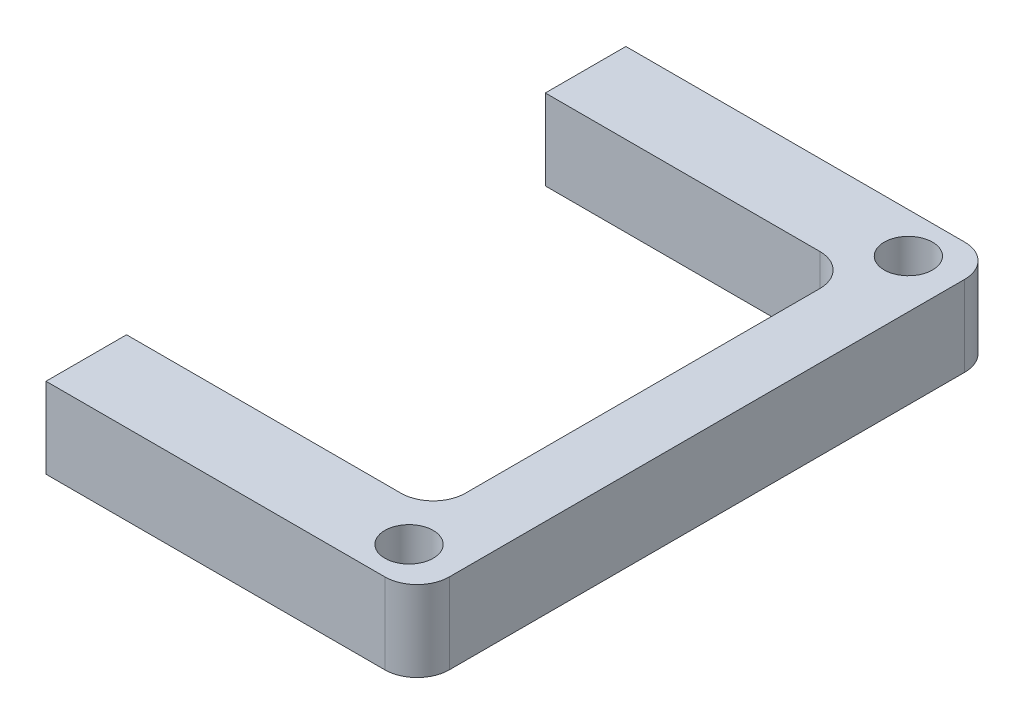
ISO-10303-21;
HEADER;
FILE_DESCRIPTION(('STEP AP214'),'2;1');
FILE_NAME('part.step','',(''),(''),'','','');
FILE_SCHEMA(('AUTOMOTIVE_DESIGN { 1 0 10303 214 1 1 1 1 }'));
ENDSEC;
DATA;
#1=APPLICATION_CONTEXT('core data for automotive mechanical design processes');
#2=APPLICATION_PROTOCOL_DEFINITION('international standard','automotive_design',2000,#1);
#3=PRODUCT_CONTEXT('',#1,'mechanical');
#4=PRODUCT('Part','Part','',(#3));
#5=PRODUCT_RELATED_PRODUCT_CATEGORY('part','',(#4));
#6=PRODUCT_DEFINITION_FORMATION('','',#4);
#7=PRODUCT_DEFINITION_CONTEXT('part definition',#1,'design');
#8=PRODUCT_DEFINITION('design','',#6,#7);
#9=PRODUCT_DEFINITION_SHAPE('','',#8);
#10=(LENGTH_UNIT() NAMED_UNIT(*) SI_UNIT(.MILLI.,.METRE.));
#11=(NAMED_UNIT(*) PLANE_ANGLE_UNIT() SI_UNIT($,.RADIAN.));
#12=(NAMED_UNIT(*) SI_UNIT($,.STERADIAN.) SOLID_ANGLE_UNIT());
#13=UNCERTAINTY_MEASURE_WITH_UNIT(LENGTH_MEASURE(1.E-05),#10,'distance_accuracy_value','');
#14=(GEOMETRIC_REPRESENTATION_CONTEXT(3) GLOBAL_UNCERTAINTY_ASSIGNED_CONTEXT((#13)) GLOBAL_UNIT_ASSIGNED_CONTEXT((#10,
#11,#12)) REPRESENTATION_CONTEXT('',''));
#15=CARTESIAN_POINT('',(0.,0.,0.));
#16=DIRECTION('',(0.,0.,1.));
#17=DIRECTION('',(1.,0.,0.));
#18=AXIS2_PLACEMENT_3D('',#15,#16,#17);
#19=CARTESIAN_POINT('',(0.,5.,-31.));
#20=DIRECTION('',(0.,0.,1.));
#21=DIRECTION('',(1.,0.,0.));
#22=AXIS2_PLACEMENT_3D('',#19,#20,#21);
#23=PLANE('',#22);
#24=DIRECTION('',(0.,1.,0.));
#25=VECTOR('',#24,1.);
#26=CARTESIAN_POINT('',(5.96157483178672,5.,-31.));
#27=LINE('',#26,#25);
#28=CARTESIAN_POINT('',(5.96157483178672,0.,-31.));
#29=VERTEX_POINT('',#28);
#30=CARTESIAN_POINT('',(5.96157483178672,5.,-31.));
#31=VERTEX_POINT('',#30);
#32=EDGE_CURVE('E290',#29,#31,#27,.T.);
#33=ORIENTED_EDGE('',*,*,#32,.F.);
#34=DIRECTION('',(-1.,0.,0.));
#35=VECTOR('',#34,1.);
#36=CARTESIAN_POINT('',(0.,0.,-31.));
#37=LINE('',#36,#35);
#38=CARTESIAN_POINT('',(23.,0.,-31.));
#39=VERTEX_POINT('',#38);
#40=EDGE_CURVE('E175',#39,#29,#37,.T.);
#41=ORIENTED_EDGE('',*,*,#40,.F.);
#42=DIRECTION('',(0.,-1.,0.));
#43=VECTOR('',#42,1.);
#44=CARTESIAN_POINT('',(23.,5.,-31.));
#45=LINE('',#44,#43);
#46=CARTESIAN_POINT('',(23.,5.,-31.));
#47=VERTEX_POINT('',#46);
#48=EDGE_CURVE('E234',#39,#47,#45,.F.);
#49=ORIENTED_EDGE('',*,*,#48,.T.);
#50=DIRECTION('',(-1.,0.,0.));
#51=VECTOR('',#50,1.);
#52=CARTESIAN_POINT('',(0.,5.,-31.));
#53=LINE('',#52,#51);
#54=EDGE_CURVE('E291',#47,#31,#53,.T.);
#55=ORIENTED_EDGE('',*,*,#54,.T.);
#56=EDGE_LOOP('',(#33,#41,#49,#55));
#57=FACE_BOUND('',#56,.T.);
#58=ADVANCED_FACE('F41',(#57),#23,.T.);
#59=CARTESIAN_POINT('',(25.,5.,0.));
#60=DIRECTION('',(-1.,0.,0.));
#61=DIRECTION('',(0.,0.,1.));
#62=AXIS2_PLACEMENT_3D('',#59,#60,#61);
#63=PLANE('',#62);
#64=DIRECTION('',(0.,0.,-1.));
#65=VECTOR('',#64,1.);
#66=CARTESIAN_POINT('',(25.,0.,0.));
#67=LINE('',#66,#65);
#68=CARTESIAN_POINT('',(25.,0.,-7.));
#69=VERTEX_POINT('',#68);
#70=CARTESIAN_POINT('',(25.,0.,-29.));
#71=VERTEX_POINT('',#70);
#72=EDGE_CURVE('E179',#69,#71,#67,.T.);
#73=ORIENTED_EDGE('',*,*,#72,.F.);
#74=DIRECTION('',(0.,-1.,0.));
#75=VECTOR('',#74,1.);
#76=CARTESIAN_POINT('',(25.,5.,-7.));
#77=LINE('',#76,#75);
#78=CARTESIAN_POINT('',(25.,5.,-7.));
#79=VERTEX_POINT('',#78);
#80=EDGE_CURVE('E231',#69,#79,#77,.F.);
#81=ORIENTED_EDGE('',*,*,#80,.T.);
#82=DIRECTION('',(0.,0.,-1.));
#83=VECTOR('',#82,1.);
#84=CARTESIAN_POINT('',(25.,5.,0.));
#85=LINE('',#84,#83);
#86=CARTESIAN_POINT('',(25.,5.,-29.));
#87=VERTEX_POINT('',#86);
#88=EDGE_CURVE('E160',#79,#87,#85,.T.);
#89=ORIENTED_EDGE('',*,*,#88,.T.);
#90=DIRECTION('',(0.,-1.,0.));
#91=VECTOR('',#90,1.);
#92=CARTESIAN_POINT('',(25.,0.,-29.));
#93=LINE('',#92,#91);
#94=EDGE_CURVE('E227',#87,#71,#93,.T.);
#95=ORIENTED_EDGE('',*,*,#94,.T.);
#96=EDGE_LOOP('',(#73,#81,#89,#95));
#97=FACE_BOUND('',#96,.T.);
#98=ADVANCED_FACE('F284',(#97),#63,.T.);
#99=CARTESIAN_POINT('',(0.,5.,-5.));
#100=DIRECTION('',(0.,0.,-1.));
#101=DIRECTION('',(-1.,0.,0.));
#102=AXIS2_PLACEMENT_3D('',#99,#100,#101);
#103=PLANE('',#102);
#104=DIRECTION('',(0.,-1.,0.));
#105=VECTOR('',#104,1.);
#106=CARTESIAN_POINT('',(5.96157483178672,5.,-5.));
#107=LINE('',#106,#105);
#108=CARTESIAN_POINT('',(5.96157483178672,5.,-5.));
#109=VERTEX_POINT('',#108);
#110=CARTESIAN_POINT('',(5.96157483178672,0.,-5.));
#111=VERTEX_POINT('',#110);
#112=EDGE_CURVE('E57',#109,#111,#107,.T.);
#113=ORIENTED_EDGE('',*,*,#112,.F.);
#114=DIRECTION('',(1.,0.,0.));
#115=VECTOR('',#114,1.);
#116=CARTESIAN_POINT('',(0.,5.,-5.));
#117=LINE('',#116,#115);
#118=CARTESIAN_POINT('',(23.,5.,-5.));
#119=VERTEX_POINT('',#118);
#120=EDGE_CURVE('E144',#109,#119,#117,.T.);
#121=ORIENTED_EDGE('',*,*,#120,.T.);
#122=DIRECTION('',(0.,-1.,0.));
#123=VECTOR('',#122,1.);
#124=CARTESIAN_POINT('',(23.,0.,-5.));
#125=LINE('',#124,#123);
#126=CARTESIAN_POINT('',(23.,0.,-5.));
#127=VERTEX_POINT('',#126);
#128=EDGE_CURVE('E223',#119,#127,#125,.T.);
#129=ORIENTED_EDGE('',*,*,#128,.T.);
#130=DIRECTION('',(1.,0.,0.));
#131=VECTOR('',#130,1.);
#132=CARTESIAN_POINT('',(0.,0.,-5.));
#133=LINE('',#132,#131);
#134=EDGE_CURVE('E183',#111,#127,#133,.T.);
#135=ORIENTED_EDGE('',*,*,#134,.F.);
#136=EDGE_LOOP('',(#113,#121,#129,#135));
#137=FACE_BOUND('',#136,.T.);
#138=ADVANCED_FACE('F276',(#137),#103,.T.);
#139=CARTESIAN_POINT('',(0.,5.,0.));
#140=DIRECTION('',(0.,0.,-1.));
#141=DIRECTION('',(-1.,0.,0.));
#142=AXIS2_PLACEMENT_3D('',#139,#140,#141);
#143=PLANE('',#142);
#144=DIRECTION('',(1.,0.,0.));
#145=VECTOR('',#144,1.);
#146=CARTESIAN_POINT('',(0.,5.,0.));
#147=LINE('',#146,#145);
#148=CARTESIAN_POINT('',(5.96157483178672,5.,0.));
#149=VERTEX_POINT('',#148);
#150=CARTESIAN_POINT('',(27.,5.,0.));
#151=VERTEX_POINT('',#150);
#152=EDGE_CURVE('E141',#149,#151,#147,.T.);
#153=ORIENTED_EDGE('',*,*,#152,.F.);
#154=DIRECTION('',(0.,1.,0.));
#155=VECTOR('',#154,1.);
#156=CARTESIAN_POINT('',(5.96157483178672,-5.,0.));
#157=LINE('',#156,#155);
#158=CARTESIAN_POINT('',(5.96157483178672,0.,0.));
#159=VERTEX_POINT('',#158);
#160=EDGE_CURVE('E128',#159,#149,#157,.T.);
#161=ORIENTED_EDGE('',*,*,#160,.F.);
#162=DIRECTION('',(1.,0.,0.));
#163=VECTOR('',#162,1.);
#164=CARTESIAN_POINT('',(0.,0.,0.));
#165=LINE('',#164,#163);
#166=CARTESIAN_POINT('',(27.,0.,0.));
#167=VERTEX_POINT('',#166);
#168=EDGE_CURVE('E186',#159,#167,#165,.T.);
#169=ORIENTED_EDGE('',*,*,#168,.T.);
#170=DIRECTION('',(0.,-1.,0.));
#171=VECTOR('',#170,1.);
#172=CARTESIAN_POINT('',(27.,5.,0.));
#173=LINE('',#172,#171);
#174=EDGE_CURVE('E150',#167,#151,#173,.F.);
#175=ORIENTED_EDGE('',*,*,#174,.T.);
#176=EDGE_LOOP('',(#153,#161,#169,#175));
#177=FACE_BOUND('',#176,.T.);
#178=ADVANCED_FACE('F148',(#177),#143,.F.);
#179=CARTESIAN_POINT('',(29.,5.,0.));
#180=DIRECTION('',(-1.,0.,0.));
#181=DIRECTION('',(0.,0.,1.));
#182=AXIS2_PLACEMENT_3D('',#179,#180,#181);
#183=PLANE('',#182);
#184=DIRECTION('',(0.,0.,-1.));
#185=VECTOR('',#184,1.);
#186=CARTESIAN_POINT('',(29.,0.,0.));
#187=LINE('',#186,#185);
#188=CARTESIAN_POINT('',(29.,0.,-2.));
#189=VERTEX_POINT('',#188);
#190=CARTESIAN_POINT('',(29.,0.,-34.));
#191=VERTEX_POINT('',#190);
#192=EDGE_CURVE('E189',#189,#191,#187,.T.);
#193=ORIENTED_EDGE('',*,*,#192,.T.);
#194=DIRECTION('',(0.,-1.,0.));
#195=VECTOR('',#194,1.);
#196=CARTESIAN_POINT('',(29.,5.,-34.));
#197=LINE('',#196,#195);
#198=CARTESIAN_POINT('',(29.,5.,-34.));
#199=VERTEX_POINT('',#198);
#200=EDGE_CURVE('E211',#191,#199,#197,.F.);
#201=ORIENTED_EDGE('',*,*,#200,.T.);
#202=DIRECTION('',(0.,0.,-1.));
#203=VECTOR('',#202,1.);
#204=CARTESIAN_POINT('',(29.,5.,0.));
#205=LINE('',#204,#203);
#206=CARTESIAN_POINT('',(29.,5.,-2.));
#207=VERTEX_POINT('',#206);
#208=EDGE_CURVE('E153',#207,#199,#205,.T.);
#209=ORIENTED_EDGE('',*,*,#208,.F.);
#210=DIRECTION('',(0.,-1.,0.));
#211=VECTOR('',#210,1.);
#212=CARTESIAN_POINT('',(29.,5.,-2.));
#213=LINE('',#212,#211);
#214=EDGE_CURVE('E207',#207,#189,#213,.T.);
#215=ORIENTED_EDGE('',*,*,#214,.T.);
#216=EDGE_LOOP('',(#193,#201,#209,#215));
#217=FACE_BOUND('',#216,.T.);
#218=ADVANCED_FACE('F268',(#217),#183,.F.);
#219=CARTESIAN_POINT('',(26.,5.,-33.5));
#220=DIRECTION('',(0.,-1.,0.));
#221=DIRECTION('',(0.,0.,-1.));
#222=AXIS2_PLACEMENT_3D('',#219,#220,#221);
#223=CYLINDRICAL_SURFACE('',#222,1.5);
#224=CARTESIAN_POINT('',(26.,5.,-33.5));
#225=DIRECTION('',(0.,1.,0.));
#226=DIRECTION('',(0.,0.,1.));
#227=AXIS2_PLACEMENT_3D('',#224,#225,#226);
#228=CIRCLE('',#227,1.5);
#229=CARTESIAN_POINT('',(26.,5.,-32.));
#230=VERTEX_POINT('',#229);
#231=EDGE_CURVE('E303',#230,#230,#228,.T.);
#232=ORIENTED_EDGE('',*,*,#231,.T.);
#233=EDGE_LOOP('',(#232));
#234=FACE_BOUND('',#233,.T.);
#235=CARTESIAN_POINT('',(26.,0.,-33.5));
#236=DIRECTION('',(0.,1.,0.));
#237=DIRECTION('',(0.,0.,1.));
#238=AXIS2_PLACEMENT_3D('',#235,#236,#237);
#239=CIRCLE('',#238,1.5);
#240=CARTESIAN_POINT('',(26.,0.,-32.));
#241=VERTEX_POINT('',#240);
#242=EDGE_CURVE('E171',#241,#241,#239,.T.);
#243=ORIENTED_EDGE('',*,*,#242,.F.);
#244=EDGE_LOOP('',(#243));
#245=FACE_BOUND('',#244,.T.);
#246=ADVANCED_FACE('F311',(#234,#245),#223,.F.);
#247=CARTESIAN_POINT('',(26.,5.,-2.5));
#248=DIRECTION('',(0.,-1.,0.));
#249=DIRECTION('',(0.,0.,-1.));
#250=AXIS2_PLACEMENT_3D('',#247,#248,#249);
#251=CYLINDRICAL_SURFACE('',#250,1.5);
#252=CARTESIAN_POINT('',(26.,5.,-2.5));
#253=DIRECTION('',(0.,1.,0.));
#254=DIRECTION('',(0.,0.,1.));
#255=AXIS2_PLACEMENT_3D('',#252,#253,#254);
#256=CIRCLE('',#255,1.5);
#257=CARTESIAN_POINT('',(26.,5.,-0.999999999999999));
#258=VERTEX_POINT('',#257);
#259=EDGE_CURVE('E196',#258,#258,#256,.T.);
#260=ORIENTED_EDGE('',*,*,#259,.T.);
#261=EDGE_LOOP('',(#260));
#262=FACE_BOUND('',#261,.T.);
#263=CARTESIAN_POINT('',(26.,0.,-2.5));
#264=DIRECTION('',(0.,1.,0.));
#265=DIRECTION('',(0.,0.,1.));
#266=AXIS2_PLACEMENT_3D('',#263,#264,#265);
#267=CIRCLE('',#266,1.5);
#268=CARTESIAN_POINT('',(26.,0.,-0.999999999999999));
#269=VERTEX_POINT('',#268);
#270=EDGE_CURVE('E167',#269,#269,#267,.T.);
#271=ORIENTED_EDGE('',*,*,#270,.F.);
#272=EDGE_LOOP('',(#271));
#273=FACE_BOUND('',#272,.T.);
#274=ADVANCED_FACE('F322',(#262,#273),#251,.F.);
#275=CARTESIAN_POINT('',(0.,5.,-36.));
#276=DIRECTION('',(0.,0.,-1.));
#277=DIRECTION('',(-1.,0.,0.));
#278=AXIS2_PLACEMENT_3D('',#275,#276,#277);
#279=PLANE('',#278);
#280=DIRECTION('',(0.,1.,0.));
#281=VECTOR('',#280,1.);
#282=CARTESIAN_POINT('',(5.96157483178672,-5.,-36.));
#283=LINE('',#282,#281);
#284=CARTESIAN_POINT('',(5.96157483178672,0.,-36.));
#285=VERTEX_POINT('',#284);
#286=CARTESIAN_POINT('',(5.96157483178672,5.,-36.));
#287=VERTEX_POINT('',#286);
#288=EDGE_CURVE('E64',#285,#287,#283,.T.);
#289=ORIENTED_EDGE('',*,*,#288,.T.);
#290=DIRECTION('',(1.,0.,0.));
#291=VECTOR('',#290,1.);
#292=CARTESIAN_POINT('',(0.,5.,-36.));
#293=LINE('',#292,#291);
#294=CARTESIAN_POINT('',(27.,5.,-36.));
#295=VERTEX_POINT('',#294);
#296=EDGE_CURVE('E158',#287,#295,#293,.T.);
#297=ORIENTED_EDGE('',*,*,#296,.T.);
#298=DIRECTION('',(0.,-1.,0.));
#299=VECTOR('',#298,1.);
#300=CARTESIAN_POINT('',(27.,0.,-36.));
#301=LINE('',#300,#299);
#302=CARTESIAN_POINT('',(27.,0.,-36.));
#303=VERTEX_POINT('',#302);
#304=EDGE_CURVE('E166',#295,#303,#301,.T.);
#305=ORIENTED_EDGE('',*,*,#304,.T.);
#306=DIRECTION('',(1.,0.,0.));
#307=VECTOR('',#306,1.);
#308=CARTESIAN_POINT('',(0.,0.,-36.));
#309=LINE('',#308,#307);
#310=EDGE_CURVE('E193',#285,#303,#309,.T.);
#311=ORIENTED_EDGE('',*,*,#310,.F.);
#312=EDGE_LOOP('',(#289,#297,#305,#311));
#313=FACE_BOUND('',#312,.T.);
#314=ADVANCED_FACE('F259',(#313),#279,.T.);
#315=CARTESIAN_POINT('',(0.,5.,0.));
#316=DIRECTION('',(0.,1.,0.));
#317=DIRECTION('',(0.,0.,1.));
#318=AXIS2_PLACEMENT_3D('',#315,#316,#317);
#319=PLANE('',#318);
#320=DIRECTION('',(0.,0.,-1.));
#321=VECTOR('',#320,1.);
#322=CARTESIAN_POINT('',(5.96157483178672,5.,0.));
#323=LINE('',#322,#321);
#324=EDGE_CURVE('E131',#149,#109,#323,.T.);
#325=ORIENTED_EDGE('',*,*,#324,.F.);
#326=ORIENTED_EDGE('',*,*,#152,.T.);
#327=CARTESIAN_POINT('',(27.,5.,-2.));
#328=DIRECTION('',(0.,1.,0.));
#329=DIRECTION('',(0.,0.,1.));
#330=AXIS2_PLACEMENT_3D('',#327,#328,#329);
#331=CIRCLE('',#330,2.);
#332=EDGE_CURVE('E214',#151,#207,#331,.T.);
#333=ORIENTED_EDGE('',*,*,#332,.T.);
#334=ORIENTED_EDGE('',*,*,#208,.T.);
#335=CARTESIAN_POINT('',(27.,5.,-34.));
#336=DIRECTION('',(0.,1.,0.));
#337=DIRECTION('',(0.,0.,1.));
#338=AXIS2_PLACEMENT_3D('',#335,#336,#337);
#339=CIRCLE('',#338,2.);
#340=EDGE_CURVE('E217',#199,#295,#339,.T.);
#341=ORIENTED_EDGE('',*,*,#340,.T.);
#342=ORIENTED_EDGE('',*,*,#296,.F.);
#343=EDGE_CURVE('E146',#31,#287,#323,.T.);
#344=ORIENTED_EDGE('',*,*,#343,.F.);
#345=ORIENTED_EDGE('',*,*,#54,.F.);
#346=CARTESIAN_POINT('',(23.,5.,-29.));
#347=DIRECTION('',(0.,1.,0.));
#348=DIRECTION('',(0.,0.,1.));
#349=AXIS2_PLACEMENT_3D('',#346,#347,#348);
#350=CIRCLE('',#349,2.);
#351=EDGE_CURVE('E245',#47,#87,#350,.F.);
#352=ORIENTED_EDGE('',*,*,#351,.T.);
#353=ORIENTED_EDGE('',*,*,#88,.F.);
#354=CARTESIAN_POINT('',(23.,5.,-7.));
#355=DIRECTION('',(0.,1.,0.));
#356=DIRECTION('',(0.,0.,1.));
#357=AXIS2_PLACEMENT_3D('',#354,#355,#356);
#358=CIRCLE('',#357,2.);
#359=EDGE_CURVE('E240',#79,#119,#358,.F.);
#360=ORIENTED_EDGE('',*,*,#359,.T.);
#361=ORIENTED_EDGE('',*,*,#120,.F.);
#362=EDGE_LOOP('',(#325,#326,#333,#334,#341,#342,#344,#345,#352,#353,#360,#361));
#363=FACE_BOUND('',#362,.T.);
#364=ORIENTED_EDGE('',*,*,#259,.F.);
#365=EDGE_LOOP('',(#364));
#366=FACE_BOUND('',#365,.T.);
#367=ORIENTED_EDGE('',*,*,#231,.F.);
#368=EDGE_LOOP('',(#367));
#369=FACE_BOUND('',#368,.T.);
#370=ADVANCED_FACE('F139',(#363,#366,#369),#319,.T.);
#371=CARTESIAN_POINT('',(0.,0.,0.));
#372=DIRECTION('',(0.,1.,0.));
#373=DIRECTION('',(0.,0.,1.));
#374=AXIS2_PLACEMENT_3D('',#371,#372,#373);
#375=PLANE('',#374);
#376=ORIENTED_EDGE('',*,*,#270,.T.);
#377=EDGE_LOOP('',(#376));
#378=FACE_BOUND('',#377,.T.);
#379=ORIENTED_EDGE('',*,*,#242,.T.);
#380=EDGE_LOOP('',(#379));
#381=FACE_BOUND('',#380,.T.);
#382=ORIENTED_EDGE('',*,*,#168,.F.);
#383=DIRECTION('',(0.,0.,-1.));
#384=VECTOR('',#383,1.);
#385=CARTESIAN_POINT('',(5.96157483178672,0.,0.));
#386=LINE('',#385,#384);
#387=EDGE_CURVE('E11',#159,#111,#386,.T.);
#388=ORIENTED_EDGE('',*,*,#387,.T.);
#389=ORIENTED_EDGE('',*,*,#134,.T.);
#390=CARTESIAN_POINT('',(23.,0.,-7.));
#391=DIRECTION('',(0.,1.,0.));
#392=DIRECTION('',(0.,0.,1.));
#393=AXIS2_PLACEMENT_3D('',#390,#391,#392);
#394=CIRCLE('',#393,2.);
#395=EDGE_CURVE('E237',#127,#69,#394,.T.);
#396=ORIENTED_EDGE('',*,*,#395,.T.);
#397=ORIENTED_EDGE('',*,*,#72,.T.);
#398=CARTESIAN_POINT('',(23.,0.,-29.));
#399=DIRECTION('',(0.,1.,0.));
#400=DIRECTION('',(0.,0.,1.));
#401=AXIS2_PLACEMENT_3D('',#398,#399,#400);
#402=CIRCLE('',#401,2.);
#403=EDGE_CURVE('E243',#71,#39,#402,.T.);
#404=ORIENTED_EDGE('',*,*,#403,.T.);
#405=ORIENTED_EDGE('',*,*,#40,.T.);
#406=EDGE_CURVE('E45',#29,#285,#386,.T.);
#407=ORIENTED_EDGE('',*,*,#406,.T.);
#408=ORIENTED_EDGE('',*,*,#310,.T.);
#409=CARTESIAN_POINT('',(27.,0.,-34.));
#410=DIRECTION('',(0.,1.,0.));
#411=DIRECTION('',(0.,0.,1.));
#412=AXIS2_PLACEMENT_3D('',#409,#410,#411);
#413=CIRCLE('',#412,2.);
#414=EDGE_CURVE('E204',#303,#191,#413,.F.);
#415=ORIENTED_EDGE('',*,*,#414,.T.);
#416=ORIENTED_EDGE('',*,*,#192,.F.);
#417=CARTESIAN_POINT('',(27.,0.,-2.));
#418=DIRECTION('',(0.,1.,0.));
#419=DIRECTION('',(0.,0.,1.));
#420=AXIS2_PLACEMENT_3D('',#417,#418,#419);
#421=CIRCLE('',#420,2.);
#422=EDGE_CURVE('E200',#189,#167,#421,.F.);
#423=ORIENTED_EDGE('',*,*,#422,.T.);
#424=EDGE_LOOP('',(#382,#388,#389,#396,#397,#404,#405,#407,#408,#415,#416,#423));
#425=FACE_BOUND('',#424,.T.);
#426=ADVANCED_FACE('F254',(#378,#381,#425),#375,.F.);
#427=CARTESIAN_POINT('',(27.,5.,-34.));
#428=DIRECTION('',(0.,1.,0.));
#429=DIRECTION('',(0.,0.,1.));
#430=AXIS2_PLACEMENT_3D('',#427,#428,#429);
#431=CYLINDRICAL_SURFACE('',#430,2.);
#432=ORIENTED_EDGE('',*,*,#340,.F.);
#433=ORIENTED_EDGE('',*,*,#200,.F.);
#434=ORIENTED_EDGE('',*,*,#414,.F.);
#435=ORIENTED_EDGE('',*,*,#304,.F.);
#436=EDGE_LOOP('',(#432,#433,#434,#435));
#437=FACE_BOUND('',#436,.T.);
#438=ADVANCED_FACE('F264',(#437),#431,.T.);
#439=CARTESIAN_POINT('',(27.,5.,-2.));
#440=DIRECTION('',(0.,-1.,0.));
#441=DIRECTION('',(0.,0.,-1.));
#442=AXIS2_PLACEMENT_3D('',#439,#440,#441);
#443=CYLINDRICAL_SURFACE('',#442,2.);
#444=ORIENTED_EDGE('',*,*,#332,.F.);
#445=ORIENTED_EDGE('',*,*,#174,.F.);
#446=ORIENTED_EDGE('',*,*,#422,.F.);
#447=ORIENTED_EDGE('',*,*,#214,.F.);
#448=EDGE_LOOP('',(#444,#445,#446,#447));
#449=FACE_BOUND('',#448,.T.);
#450=ADVANCED_FACE('F272',(#449),#443,.T.);
#451=CARTESIAN_POINT('',(23.,5.,-7.));
#452=DIRECTION('',(0.,1.,0.));
#453=DIRECTION('',(0.,0.,1.));
#454=AXIS2_PLACEMENT_3D('',#451,#452,#453);
#455=CYLINDRICAL_SURFACE('',#454,2.);
#456=ORIENTED_EDGE('',*,*,#359,.F.);
#457=ORIENTED_EDGE('',*,*,#80,.F.);
#458=ORIENTED_EDGE('',*,*,#395,.F.);
#459=ORIENTED_EDGE('',*,*,#128,.F.);
#460=EDGE_LOOP('',(#456,#457,#458,#459));
#461=FACE_BOUND('',#460,.T.);
#462=ADVANCED_FACE('F280',(#461),#455,.F.);
#463=CARTESIAN_POINT('',(23.,5.,-29.));
#464=DIRECTION('',(0.,1.,0.));
#465=DIRECTION('',(0.,0.,1.));
#466=AXIS2_PLACEMENT_3D('',#463,#464,#465);
#467=CYLINDRICAL_SURFACE('',#466,2.);
#468=ORIENTED_EDGE('',*,*,#351,.F.);
#469=ORIENTED_EDGE('',*,*,#48,.F.);
#470=ORIENTED_EDGE('',*,*,#403,.F.);
#471=ORIENTED_EDGE('',*,*,#94,.F.);
#472=EDGE_LOOP('',(#468,#469,#470,#471));
#473=FACE_BOUND('',#472,.T.);
#474=ADVANCED_FACE('F43',(#473),#467,.F.);
#475=CARTESIAN_POINT('',(5.96157483178672,-5.,0.));
#476=DIRECTION('',(1.,0.,0.));
#477=DIRECTION('',(0.,0.,-1.));
#478=AXIS2_PLACEMENT_3D('',#475,#476,#477);
#479=PLANE('',#478);
#480=ORIENTED_EDGE('',*,*,#32,.T.);
#481=ORIENTED_EDGE('',*,*,#343,.T.);
#482=ORIENTED_EDGE('',*,*,#288,.F.);
#483=ORIENTED_EDGE('',*,*,#406,.F.);
#484=EDGE_LOOP('',(#480,#481,#482,#483));
#485=FACE_BOUND('',#484,.T.);
#486=ADVANCED_FACE('F345',(#485),#479,.F.);
#487=ORIENTED_EDGE('',*,*,#112,.T.);
#488=ORIENTED_EDGE('',*,*,#387,.F.);
#489=ORIENTED_EDGE('',*,*,#160,.T.);
#490=ORIENTED_EDGE('',*,*,#324,.T.);
#491=EDGE_LOOP('',(#487,#488,#489,#490));
#492=FACE_BOUND('',#491,.T.);
#493=ADVANCED_FACE('F130',(#492),#479,.F.);
#494=CLOSED_SHELL('',(#58,#98,#138,#178,#218,#246,#274,#314,#370,#426,#438,#450,#462,#474,#486,#493));
#495=MANIFOLD_SOLID_BREP('B2',#494);
#496=ADVANCED_BREP_SHAPE_REPRESENTATION('',(#18,#495),#14);
#497=SHAPE_DEFINITION_REPRESENTATION(#9,#496);
ENDSEC;
END-ISO-10303-21;
